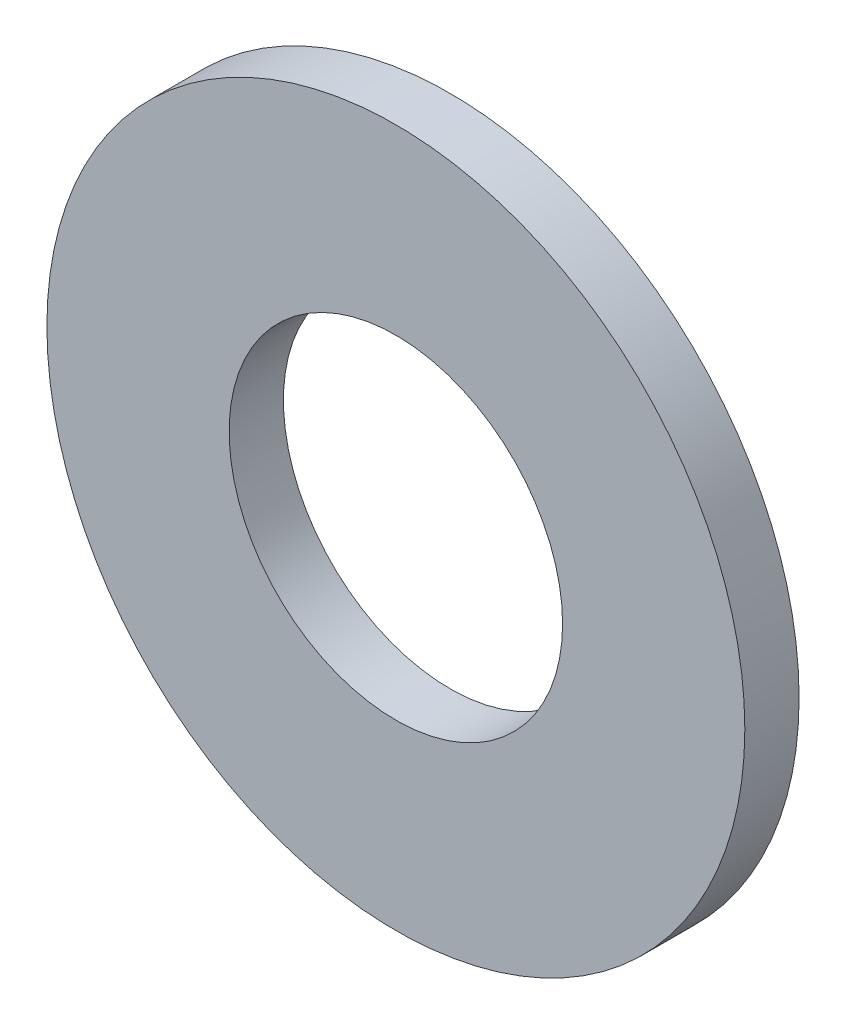
ISO-10303-21;
HEADER;
FILE_DESCRIPTION(('STEP AP214'),'2;1');
FILE_NAME('part.step','',(''),(''),'','','');
FILE_SCHEMA(('AUTOMOTIVE_DESIGN { 1 0 10303 214 1 1 1 1 }'));
ENDSEC;
DATA;
#1=APPLICATION_CONTEXT('core data for automotive mechanical design processes');
#2=APPLICATION_PROTOCOL_DEFINITION('international standard','automotive_design',2000,#1);
#3=PRODUCT_CONTEXT('',#1,'mechanical');
#4=PRODUCT('Part','Part','',(#3));
#5=PRODUCT_RELATED_PRODUCT_CATEGORY('part','',(#4));
#6=PRODUCT_DEFINITION_FORMATION('','',#4);
#7=PRODUCT_DEFINITION_CONTEXT('part definition',#1,'design');
#8=PRODUCT_DEFINITION('design','',#6,#7);
#9=PRODUCT_DEFINITION_SHAPE('','',#8);
#10=(LENGTH_UNIT() NAMED_UNIT(*) SI_UNIT(.MILLI.,.METRE.));
#11=(NAMED_UNIT(*) PLANE_ANGLE_UNIT() SI_UNIT($,.RADIAN.));
#12=(NAMED_UNIT(*) SI_UNIT($,.STERADIAN.) SOLID_ANGLE_UNIT());
#13=UNCERTAINTY_MEASURE_WITH_UNIT(LENGTH_MEASURE(1.E-05),#10,'distance_accuracy_value','');
#14=(GEOMETRIC_REPRESENTATION_CONTEXT(3) GLOBAL_UNCERTAINTY_ASSIGNED_CONTEXT((#13)) GLOBAL_UNIT_ASSIGNED_CONTEXT((#10,
#11,#12)) REPRESENTATION_CONTEXT('',''));
#15=CARTESIAN_POINT('',(0.,0.,0.));
#16=DIRECTION('',(0.,0.,1.));
#17=DIRECTION('',(1.,0.,0.));
#18=AXIS2_PLACEMENT_3D('',#15,#16,#17);
#19=CARTESIAN_POINT('',(0.,0.,-0.7));
#20=DIRECTION('',(0.,0.,1.));
#21=DIRECTION('',(1.,0.,0.));
#22=AXIS2_PLACEMENT_3D('',#19,#20,#21);
#23=CYLINDRICAL_SURFACE('',#22,4.5);
#24=CARTESIAN_POINT('',(0.,0.,-0.7));
#25=DIRECTION('',(0.,0.,1.));
#26=DIRECTION('',(1.,0.,0.));
#27=AXIS2_PLACEMENT_3D('',#24,#25,#26);
#28=CIRCLE('',#27,4.5);
#29=CARTESIAN_POINT('',(4.5,0.,-0.7));
#30=VERTEX_POINT('',#29);
#31=EDGE_CURVE('E10',#30,#30,#28,.T.);
#32=ORIENTED_EDGE('',*,*,#31,.T.);
#33=EDGE_LOOP('',(#32));
#34=FACE_BOUND('',#33,.T.);
#35=CARTESIAN_POINT('',(0.,0.,0.));
#36=DIRECTION('',(0.,0.,1.));
#37=DIRECTION('',(1.,0.,0.));
#38=AXIS2_PLACEMENT_3D('',#35,#36,#37);
#39=CIRCLE('',#38,4.5);
#40=CARTESIAN_POINT('',(4.5,0.,0.));
#41=VERTEX_POINT('',#40);
#42=EDGE_CURVE('E33',#41,#41,#39,.T.);
#43=ORIENTED_EDGE('',*,*,#42,.F.);
#44=EDGE_LOOP('',(#43));
#45=FACE_BOUND('',#44,.T.);
#46=ADVANCED_FACE('F30',(#34,#45),#23,.T.);
#47=CARTESIAN_POINT('',(0.,0.,-0.7));
#48=DIRECTION('',(0.,0.,1.));
#49=DIRECTION('',(1.,0.,0.));
#50=AXIS2_PLACEMENT_3D('',#47,#48,#49);
#51=PLANE('',#50);
#52=CARTESIAN_POINT('',(0.,0.,-0.7));
#53=DIRECTION('',(0.,0.,1.));
#54=DIRECTION('',(1.,0.,0.));
#55=AXIS2_PLACEMENT_3D('',#52,#53,#54);
#56=CIRCLE('',#55,2.15);
#57=CARTESIAN_POINT('',(2.15,0.,-0.7));
#58=VERTEX_POINT('',#57);
#59=EDGE_CURVE('E40',#58,#58,#56,.T.);
#60=ORIENTED_EDGE('',*,*,#59,.T.);
#61=EDGE_LOOP('',(#60));
#62=FACE_BOUND('',#61,.T.);
#63=ORIENTED_EDGE('',*,*,#31,.F.);
#64=EDGE_LOOP('',(#63));
#65=FACE_BOUND('',#64,.T.);
#66=ADVANCED_FACE('F48',(#62,#65),#51,.F.);
#67=CARTESIAN_POINT('',(0.,0.,0.));
#68=DIRECTION('',(0.,0.,1.));
#69=DIRECTION('',(1.,0.,0.));
#70=AXIS2_PLACEMENT_3D('',#67,#68,#69);
#71=PLANE('',#70);
#72=CARTESIAN_POINT('',(0.,0.,0.));
#73=DIRECTION('',(0.,0.,1.));
#74=DIRECTION('',(1.,0.,0.));
#75=AXIS2_PLACEMENT_3D('',#72,#73,#74);
#76=CIRCLE('',#75,2.15);
#77=CARTESIAN_POINT('',(2.15,0.,0.));
#78=VERTEX_POINT('',#77);
#79=EDGE_CURVE('E42',#78,#78,#76,.T.);
#80=ORIENTED_EDGE('',*,*,#79,.F.);
#81=EDGE_LOOP('',(#80));
#82=FACE_BOUND('',#81,.T.);
#83=ORIENTED_EDGE('',*,*,#42,.T.);
#84=EDGE_LOOP('',(#83));
#85=FACE_BOUND('',#84,.T.);
#86=ADVANCED_FACE('F54',(#82,#85),#71,.T.);
#87=CARTESIAN_POINT('',(0.,0.,-0.7));
#88=DIRECTION('',(0.,0.,1.));
#89=DIRECTION('',(1.,0.,0.));
#90=AXIS2_PLACEMENT_3D('',#87,#88,#89);
#91=CYLINDRICAL_SURFACE('',#90,2.15);
#92=ORIENTED_EDGE('',*,*,#59,.F.);
#93=EDGE_LOOP('',(#92));
#94=FACE_BOUND('',#93,.T.);
#95=ORIENTED_EDGE('',*,*,#79,.T.);
#96=EDGE_LOOP('',(#95));
#97=FACE_BOUND('',#96,.T.);
#98=ADVANCED_FACE('F51',(#94,#97),#91,.F.);
#99=CLOSED_SHELL('',(#46,#66,#86,#98));
#100=MANIFOLD_SOLID_BREP('B2',#99);
#101=ADVANCED_BREP_SHAPE_REPRESENTATION('',(#18,#100),#14);
#102=SHAPE_DEFINITION_REPRESENTATION(#9,#101);
ENDSEC;
END-ISO-10303-21;
